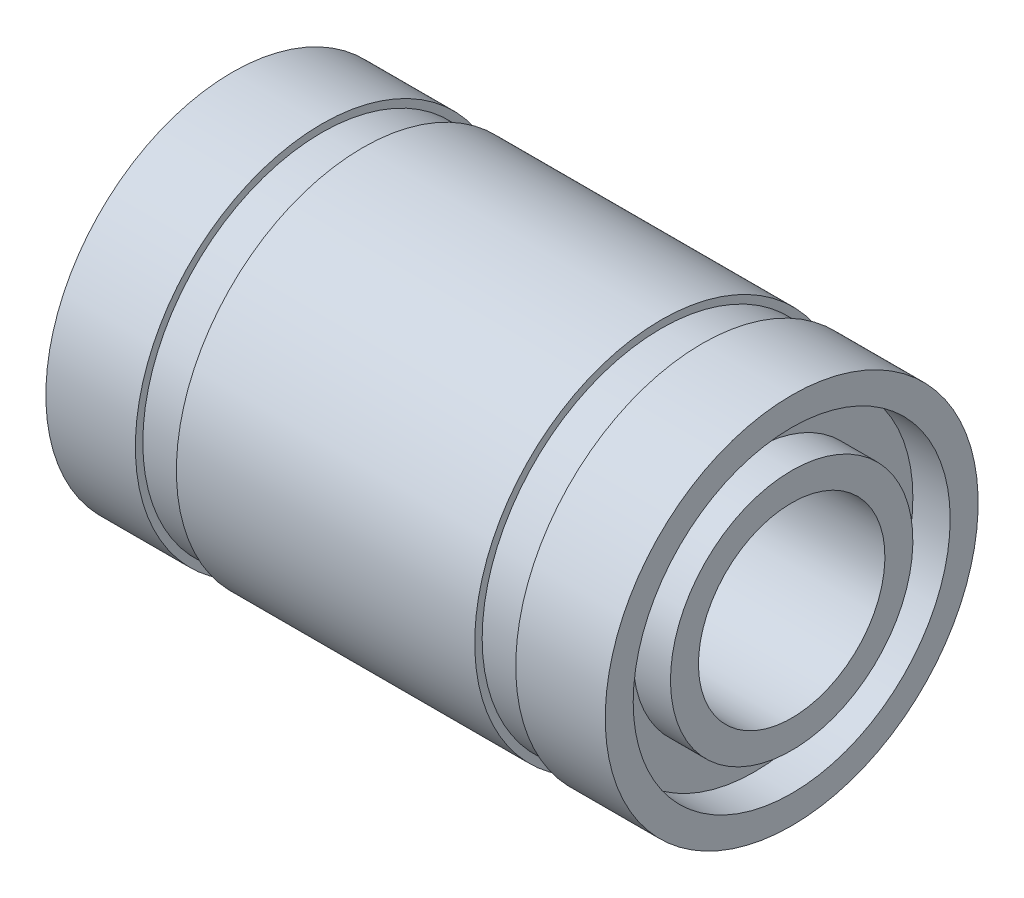
ISO-10303-21;
HEADER;
FILE_DESCRIPTION(('STEP AP214'),'2;1');
FILE_NAME('part.step','',(''),(''),'','','');
FILE_SCHEMA(('AUTOMOTIVE_DESIGN { 1 0 10303 214 1 1 1 1 }'));
ENDSEC;
DATA;
#1=APPLICATION_CONTEXT('core data for automotive mechanical design processes');
#2=APPLICATION_PROTOCOL_DEFINITION('international standard','automotive_design',2000,#1);
#3=PRODUCT_CONTEXT('',#1,'mechanical');
#4=PRODUCT('Part','Part','',(#3));
#5=PRODUCT_RELATED_PRODUCT_CATEGORY('part','',(#4));
#6=PRODUCT_DEFINITION_FORMATION('','',#4);
#7=PRODUCT_DEFINITION_CONTEXT('part definition',#1,'design');
#8=PRODUCT_DEFINITION('design','',#6,#7);
#9=PRODUCT_DEFINITION_SHAPE('','',#8);
#10=(LENGTH_UNIT() NAMED_UNIT(*) SI_UNIT(.MILLI.,.METRE.));
#11=(NAMED_UNIT(*) PLANE_ANGLE_UNIT() SI_UNIT($,.RADIAN.));
#12=(NAMED_UNIT(*) SI_UNIT($,.STERADIAN.) SOLID_ANGLE_UNIT());
#13=UNCERTAINTY_MEASURE_WITH_UNIT(LENGTH_MEASURE(1.E-05),#10,'distance_accuracy_value','');
#14=(GEOMETRIC_REPRESENTATION_CONTEXT(3) GLOBAL_UNCERTAINTY_ASSIGNED_CONTEXT((#13)) GLOBAL_UNIT_ASSIGNED_CONTEXT((#10,
#11,#12)) REPRESENTATION_CONTEXT('',''));
#15=CARTESIAN_POINT('',(0.,0.,0.));
#16=DIRECTION('',(0.,0.,1.));
#17=DIRECTION('',(1.,0.,0.));
#18=AXIS2_PLACEMENT_3D('',#15,#16,#17);
#19=CARTESIAN_POINT('',(-7.5,4.25,0.));
#20=DIRECTION('',(-1.,0.,0.));
#21=DIRECTION('',(0.,-1.,0.));
#22=AXIS2_PLACEMENT_3D('',#19,#20,#21);
#23=PLANE('',#22);
#24=CARTESIAN_POINT('',(-7.5,0.,0.));
#25=DIRECTION('',(1.,0.,0.));
#26=DIRECTION('',(0.,1.,0.));
#27=AXIS2_PLACEMENT_3D('',#24,#25,#26);
#28=CIRCLE('',#27,4.25);
#29=CARTESIAN_POINT('',(-7.5,4.25,0.));
#30=VERTEX_POINT('',#29);
#31=EDGE_CURVE('E122',#30,#30,#28,.T.);
#32=ORIENTED_EDGE('',*,*,#31,.T.);
#33=EDGE_LOOP('',(#32));
#34=FACE_BOUND('',#33,.T.);
#35=CARTESIAN_POINT('',(-7.5,0.,0.));
#36=DIRECTION('',(1.,0.,0.));
#37=DIRECTION('',(0.,1.,0.));
#38=AXIS2_PLACEMENT_3D('',#35,#36,#37);
#39=CIRCLE('',#38,5.);
#40=CARTESIAN_POINT('',(-7.5,5.,0.));
#41=VERTEX_POINT('',#40);
#42=EDGE_CURVE('E10',#41,#41,#39,.T.);
#43=ORIENTED_EDGE('',*,*,#42,.F.);
#44=EDGE_LOOP('',(#43));
#45=FACE_BOUND('',#44,.T.);
#46=ADVANCED_FACE('F38',(#34,#45),#23,.T.);
#47=CARTESIAN_POINT('',(0.,0.,0.));
#48=DIRECTION('',(1.,0.,0.));
#49=DIRECTION('',(0.,1.,0.));
#50=AXIS2_PLACEMENT_3D('',#47,#48,#49);
#51=CYLINDRICAL_SURFACE('',#50,5.);
#52=ORIENTED_EDGE('',*,*,#42,.T.);
#53=EDGE_LOOP('',(#52));
#54=FACE_BOUND('',#53,.T.);
#55=CARTESIAN_POINT('',(-5.1,0.,0.));
#56=DIRECTION('',(1.,0.,0.));
#57=DIRECTION('',(0.,1.,0.));
#58=AXIS2_PLACEMENT_3D('',#55,#56,#57);
#59=CIRCLE('',#58,5.);
#60=CARTESIAN_POINT('',(-5.1,5.,0.));
#61=VERTEX_POINT('',#60);
#62=EDGE_CURVE('E45',#61,#61,#59,.T.);
#63=ORIENTED_EDGE('',*,*,#62,.F.);
#64=EDGE_LOOP('',(#63));
#65=FACE_BOUND('',#64,.T.);
#66=ADVANCED_FACE('F140',(#54,#65),#51,.T.);
#67=CARTESIAN_POINT('',(-5.1,5.,0.));
#68=DIRECTION('',(1.,0.,0.));
#69=DIRECTION('',(0.,1.,0.));
#70=AXIS2_PLACEMENT_3D('',#67,#68,#69);
#71=PLANE('',#70);
#72=ORIENTED_EDGE('',*,*,#62,.T.);
#73=EDGE_LOOP('',(#72));
#74=FACE_BOUND('',#73,.T.);
#75=CARTESIAN_POINT('',(-5.1,0.,0.));
#76=DIRECTION('',(1.,0.,0.));
#77=DIRECTION('',(0.,1.,0.));
#78=AXIS2_PLACEMENT_3D('',#75,#76,#77);
#79=CIRCLE('',#78,4.8);
#80=CARTESIAN_POINT('',(-5.1,4.8,0.));
#81=VERTEX_POINT('',#80);
#82=EDGE_CURVE('E52',#81,#81,#79,.T.);
#83=ORIENTED_EDGE('',*,*,#82,.F.);
#84=EDGE_LOOP('',(#83));
#85=FACE_BOUND('',#84,.T.);
#86=ADVANCED_FACE('F144',(#74,#85),#71,.T.);
#87=CARTESIAN_POINT('',(0.,0.,0.));
#88=DIRECTION('',(1.,0.,0.));
#89=DIRECTION('',(0.,1.,0.));
#90=AXIS2_PLACEMENT_3D('',#87,#88,#89);
#91=CYLINDRICAL_SURFACE('',#90,4.8);
#92=ORIENTED_EDGE('',*,*,#82,.T.);
#93=EDGE_LOOP('',(#92));
#94=FACE_BOUND('',#93,.T.);
#95=CARTESIAN_POINT('',(-4.,0.,0.));
#96=DIRECTION('',(1.,0.,0.));
#97=DIRECTION('',(0.,1.,0.));
#98=AXIS2_PLACEMENT_3D('',#95,#96,#97);
#99=CIRCLE('',#98,4.8);
#100=CARTESIAN_POINT('',(-4.,4.8,0.));
#101=VERTEX_POINT('',#100);
#102=EDGE_CURVE('E59',#101,#101,#99,.T.);
#103=ORIENTED_EDGE('',*,*,#102,.F.);
#104=EDGE_LOOP('',(#103));
#105=FACE_BOUND('',#104,.T.);
#106=ADVANCED_FACE('F148',(#94,#105),#91,.T.);
#107=CARTESIAN_POINT('',(-4.,4.8,0.));
#108=DIRECTION('',(-1.,0.,0.));
#109=DIRECTION('',(0.,-1.,0.));
#110=AXIS2_PLACEMENT_3D('',#107,#108,#109);
#111=PLANE('',#110);
#112=ORIENTED_EDGE('',*,*,#102,.T.);
#113=EDGE_LOOP('',(#112));
#114=FACE_BOUND('',#113,.T.);
#115=CARTESIAN_POINT('',(-4.,0.,0.));
#116=DIRECTION('',(1.,0.,0.));
#117=DIRECTION('',(0.,1.,0.));
#118=AXIS2_PLACEMENT_3D('',#115,#116,#117);
#119=CIRCLE('',#118,5.);
#120=CARTESIAN_POINT('',(-4.,5.,0.));
#121=VERTEX_POINT('',#120);
#122=EDGE_CURVE('E65',#121,#121,#119,.T.);
#123=ORIENTED_EDGE('',*,*,#122,.F.);
#124=EDGE_LOOP('',(#123));
#125=FACE_BOUND('',#124,.T.);
#126=ADVANCED_FACE('F154',(#114,#125),#111,.T.);
#127=CARTESIAN_POINT('',(0.,0.,0.));
#128=DIRECTION('',(1.,0.,0.));
#129=DIRECTION('',(0.,1.,0.));
#130=AXIS2_PLACEMENT_3D('',#127,#128,#129);
#131=CYLINDRICAL_SURFACE('',#130,5.);
#132=ORIENTED_EDGE('',*,*,#122,.T.);
#133=EDGE_LOOP('',(#132));
#134=FACE_BOUND('',#133,.T.);
#135=CARTESIAN_POINT('',(4.,0.,0.));
#136=DIRECTION('',(1.,0.,0.));
#137=DIRECTION('',(0.,1.,0.));
#138=AXIS2_PLACEMENT_3D('',#135,#136,#137);
#139=CIRCLE('',#138,5.);
#140=CARTESIAN_POINT('',(4.,5.,0.));
#141=VERTEX_POINT('',#140);
#142=EDGE_CURVE('E69',#141,#141,#139,.T.);
#143=ORIENTED_EDGE('',*,*,#142,.F.);
#144=EDGE_LOOP('',(#143));
#145=FACE_BOUND('',#144,.T.);
#146=ADVANCED_FACE('F158',(#134,#145),#131,.T.);
#147=CARTESIAN_POINT('',(4.,5.,0.));
#148=DIRECTION('',(1.,0.,0.));
#149=DIRECTION('',(0.,1.,0.));
#150=AXIS2_PLACEMENT_3D('',#147,#148,#149);
#151=PLANE('',#150);
#152=ORIENTED_EDGE('',*,*,#142,.T.);
#153=EDGE_LOOP('',(#152));
#154=FACE_BOUND('',#153,.T.);
#155=CARTESIAN_POINT('',(4.,0.,0.));
#156=DIRECTION('',(1.,0.,0.));
#157=DIRECTION('',(0.,1.,0.));
#158=AXIS2_PLACEMENT_3D('',#155,#156,#157);
#159=CIRCLE('',#158,4.8);
#160=CARTESIAN_POINT('',(4.,4.8,0.));
#161=VERTEX_POINT('',#160);
#162=EDGE_CURVE('E72',#161,#161,#159,.T.);
#163=ORIENTED_EDGE('',*,*,#162,.F.);
#164=EDGE_LOOP('',(#163));
#165=FACE_BOUND('',#164,.T.);
#166=ADVANCED_FACE('F162',(#154,#165),#151,.T.);
#167=CARTESIAN_POINT('',(0.,0.,0.));
#168=DIRECTION('',(1.,0.,0.));
#169=DIRECTION('',(0.,1.,0.));
#170=AXIS2_PLACEMENT_3D('',#167,#168,#169);
#171=CYLINDRICAL_SURFACE('',#170,4.8);
#172=ORIENTED_EDGE('',*,*,#162,.T.);
#173=EDGE_LOOP('',(#172));
#174=FACE_BOUND('',#173,.T.);
#175=CARTESIAN_POINT('',(5.1,0.,0.));
#176=DIRECTION('',(1.,0.,0.));
#177=DIRECTION('',(0.,1.,0.));
#178=AXIS2_PLACEMENT_3D('',#175,#176,#177);
#179=CIRCLE('',#178,4.8);
#180=CARTESIAN_POINT('',(5.1,4.8,0.));
#181=VERTEX_POINT('',#180);
#182=EDGE_CURVE('E75',#181,#181,#179,.T.);
#183=ORIENTED_EDGE('',*,*,#182,.F.);
#184=EDGE_LOOP('',(#183));
#185=FACE_BOUND('',#184,.T.);
#186=ADVANCED_FACE('F166',(#174,#185),#171,.T.);
#187=CARTESIAN_POINT('',(5.1,4.8,0.));
#188=DIRECTION('',(-1.,0.,0.));
#189=DIRECTION('',(0.,-1.,0.));
#190=AXIS2_PLACEMENT_3D('',#187,#188,#189);
#191=PLANE('',#190);
#192=ORIENTED_EDGE('',*,*,#182,.T.);
#193=EDGE_LOOP('',(#192));
#194=FACE_BOUND('',#193,.T.);
#195=CARTESIAN_POINT('',(5.1,0.,0.));
#196=DIRECTION('',(1.,0.,0.));
#197=DIRECTION('',(0.,1.,0.));
#198=AXIS2_PLACEMENT_3D('',#195,#196,#197);
#199=CIRCLE('',#198,5.);
#200=CARTESIAN_POINT('',(5.1,5.,0.));
#201=VERTEX_POINT('',#200);
#202=EDGE_CURVE('E79',#201,#201,#199,.T.);
#203=ORIENTED_EDGE('',*,*,#202,.F.);
#204=EDGE_LOOP('',(#203));
#205=FACE_BOUND('',#204,.T.);
#206=ADVANCED_FACE('F170',(#194,#205),#191,.T.);
#207=CARTESIAN_POINT('',(0.,0.,0.));
#208=DIRECTION('',(1.,0.,0.));
#209=DIRECTION('',(0.,1.,0.));
#210=AXIS2_PLACEMENT_3D('',#207,#208,#209);
#211=CYLINDRICAL_SURFACE('',#210,5.00000000000001);
#212=ORIENTED_EDGE('',*,*,#202,.T.);
#213=EDGE_LOOP('',(#212));
#214=FACE_BOUND('',#213,.T.);
#215=CARTESIAN_POINT('',(7.5,0.,0.));
#216=DIRECTION('',(1.,0.,0.));
#217=DIRECTION('',(0.,1.,0.));
#218=AXIS2_PLACEMENT_3D('',#215,#216,#217);
#219=CIRCLE('',#218,5.00000000000002);
#220=CARTESIAN_POINT('',(7.5,5.00000000000002,0.));
#221=VERTEX_POINT('',#220);
#222=EDGE_CURVE('E83',#221,#221,#219,.T.);
#223=ORIENTED_EDGE('',*,*,#222,.F.);
#224=EDGE_LOOP('',(#223));
#225=FACE_BOUND('',#224,.T.);
#226=ADVANCED_FACE('F174',(#214,#225),#211,.T.);
#227=CARTESIAN_POINT('',(7.5,5.00000000000002,0.));
#228=DIRECTION('',(1.,0.,0.));
#229=DIRECTION('',(0.,1.,0.));
#230=AXIS2_PLACEMENT_3D('',#227,#228,#229);
#231=PLANE('',#230);
#232=ORIENTED_EDGE('',*,*,#222,.T.);
#233=EDGE_LOOP('',(#232));
#234=FACE_BOUND('',#233,.T.);
#235=CARTESIAN_POINT('',(7.5,0.,0.));
#236=DIRECTION('',(1.,0.,0.));
#237=DIRECTION('',(0.,1.,0.));
#238=AXIS2_PLACEMENT_3D('',#235,#236,#237);
#239=CIRCLE('',#238,4.25000000000001);
#240=CARTESIAN_POINT('',(7.5,4.25000000000001,0.));
#241=VERTEX_POINT('',#240);
#242=EDGE_CURVE('E87',#241,#241,#239,.T.);
#243=ORIENTED_EDGE('',*,*,#242,.F.);
#244=EDGE_LOOP('',(#243));
#245=FACE_BOUND('',#244,.T.);
#246=ADVANCED_FACE('F178',(#234,#245),#231,.T.);
#247=CARTESIAN_POINT('',(0.,0.,0.));
#248=DIRECTION('',(1.,0.,0.));
#249=DIRECTION('',(0.,1.,0.));
#250=AXIS2_PLACEMENT_3D('',#247,#248,#249);
#251=CYLINDRICAL_SURFACE('',#250,4.25000000000001);
#252=ORIENTED_EDGE('',*,*,#242,.T.);
#253=EDGE_LOOP('',(#252));
#254=FACE_BOUND('',#253,.T.);
#255=CARTESIAN_POINT('',(6.5,0.,0.));
#256=DIRECTION('',(1.,0.,0.));
#257=DIRECTION('',(0.,1.,0.));
#258=AXIS2_PLACEMENT_3D('',#255,#256,#257);
#259=CIRCLE('',#258,4.25000000000001);
#260=CARTESIAN_POINT('',(6.5,4.25000000000001,0.));
#261=VERTEX_POINT('',#260);
#262=EDGE_CURVE('E91',#261,#261,#259,.T.);
#263=ORIENTED_EDGE('',*,*,#262,.F.);
#264=EDGE_LOOP('',(#263));
#265=FACE_BOUND('',#264,.T.);
#266=ADVANCED_FACE('F182',(#254,#265),#251,.F.);
#267=CARTESIAN_POINT('',(6.5,4.25000000000001,0.));
#268=DIRECTION('',(1.,0.,0.));
#269=DIRECTION('',(0.,1.,0.));
#270=AXIS2_PLACEMENT_3D('',#267,#268,#269);
#271=PLANE('',#270);
#272=ORIENTED_EDGE('',*,*,#262,.T.);
#273=EDGE_LOOP('',(#272));
#274=FACE_BOUND('',#273,.T.);
#275=CARTESIAN_POINT('',(6.5,0.,0.));
#276=DIRECTION('',(1.,0.,0.));
#277=DIRECTION('',(0.,1.,0.));
#278=AXIS2_PLACEMENT_3D('',#275,#276,#277);
#279=CIRCLE('',#278,3.25000000000001);
#280=CARTESIAN_POINT('',(6.5,3.25000000000001,0.));
#281=VERTEX_POINT('',#280);
#282=EDGE_CURVE('E95',#281,#281,#279,.T.);
#283=ORIENTED_EDGE('',*,*,#282,.F.);
#284=EDGE_LOOP('',(#283));
#285=FACE_BOUND('',#284,.T.);
#286=ADVANCED_FACE('F186',(#274,#285),#271,.T.);
#287=CARTESIAN_POINT('',(0.,0.,0.));
#288=DIRECTION('',(1.,0.,0.));
#289=DIRECTION('',(0.,1.,0.));
#290=AXIS2_PLACEMENT_3D('',#287,#288,#289);
#291=CYLINDRICAL_SURFACE('',#290,3.25000000000001);
#292=ORIENTED_EDGE('',*,*,#282,.T.);
#293=EDGE_LOOP('',(#292));
#294=FACE_BOUND('',#293,.T.);
#295=CARTESIAN_POINT('',(7.5,0.,0.));
#296=DIRECTION('',(1.,0.,0.));
#297=DIRECTION('',(0.,1.,0.));
#298=AXIS2_PLACEMENT_3D('',#295,#296,#297);
#299=CIRCLE('',#298,3.25000000000001);
#300=CARTESIAN_POINT('',(7.5,3.25000000000001,0.));
#301=VERTEX_POINT('',#300);
#302=EDGE_CURVE('E99',#301,#301,#299,.T.);
#303=ORIENTED_EDGE('',*,*,#302,.F.);
#304=EDGE_LOOP('',(#303));
#305=FACE_BOUND('',#304,.T.);
#306=ADVANCED_FACE('F190',(#294,#305),#291,.T.);
#307=CARTESIAN_POINT('',(7.5,3.25000000000001,0.));
#308=DIRECTION('',(1.,0.,0.));
#309=DIRECTION('',(0.,1.,0.));
#310=AXIS2_PLACEMENT_3D('',#307,#308,#309);
#311=PLANE('',#310);
#312=ORIENTED_EDGE('',*,*,#302,.T.);
#313=EDGE_LOOP('',(#312));
#314=FACE_BOUND('',#313,.T.);
#315=CARTESIAN_POINT('',(7.5,0.,0.));
#316=DIRECTION('',(1.,0.,0.));
#317=DIRECTION('',(0.,1.,0.));
#318=AXIS2_PLACEMENT_3D('',#315,#316,#317);
#319=CIRCLE('',#318,2.5);
#320=CARTESIAN_POINT('',(7.5,2.5,0.));
#321=VERTEX_POINT('',#320);
#322=EDGE_CURVE('E103',#321,#321,#319,.T.);
#323=ORIENTED_EDGE('',*,*,#322,.F.);
#324=EDGE_LOOP('',(#323));
#325=FACE_BOUND('',#324,.T.);
#326=ADVANCED_FACE('F194',(#314,#325),#311,.T.);
#327=CARTESIAN_POINT('',(0.,0.,0.));
#328=DIRECTION('',(1.,0.,0.));
#329=DIRECTION('',(0.,1.,0.));
#330=AXIS2_PLACEMENT_3D('',#327,#328,#329);
#331=CYLINDRICAL_SURFACE('',#330,2.5);
#332=ORIENTED_EDGE('',*,*,#322,.T.);
#333=EDGE_LOOP('',(#332));
#334=FACE_BOUND('',#333,.T.);
#335=CARTESIAN_POINT('',(-7.5,0.,0.));
#336=DIRECTION('',(1.,0.,0.));
#337=DIRECTION('',(0.,1.,0.));
#338=AXIS2_PLACEMENT_3D('',#335,#336,#337);
#339=CIRCLE('',#338,2.5);
#340=CARTESIAN_POINT('',(-7.5,2.5,0.));
#341=VERTEX_POINT('',#340);
#342=EDGE_CURVE('E107',#341,#341,#339,.T.);
#343=ORIENTED_EDGE('',*,*,#342,.F.);
#344=EDGE_LOOP('',(#343));
#345=FACE_BOUND('',#344,.T.);
#346=ADVANCED_FACE('F198',(#334,#345),#331,.F.);
#347=CARTESIAN_POINT('',(-7.5,2.5,0.));
#348=DIRECTION('',(-1.,0.,0.));
#349=DIRECTION('',(0.,-1.,0.));
#350=AXIS2_PLACEMENT_3D('',#347,#348,#349);
#351=PLANE('',#350);
#352=ORIENTED_EDGE('',*,*,#342,.T.);
#353=EDGE_LOOP('',(#352));
#354=FACE_BOUND('',#353,.T.);
#355=CARTESIAN_POINT('',(-7.5,0.,0.));
#356=DIRECTION('',(1.,0.,0.));
#357=DIRECTION('',(0.,1.,0.));
#358=AXIS2_PLACEMENT_3D('',#355,#356,#357);
#359=CIRCLE('',#358,3.25);
#360=CARTESIAN_POINT('',(-7.5,3.25,0.));
#361=VERTEX_POINT('',#360);
#362=EDGE_CURVE('E111',#361,#361,#359,.T.);
#363=ORIENTED_EDGE('',*,*,#362,.F.);
#364=EDGE_LOOP('',(#363));
#365=FACE_BOUND('',#364,.T.);
#366=ADVANCED_FACE('F202',(#354,#365),#351,.T.);
#367=CARTESIAN_POINT('',(0.,0.,0.));
#368=DIRECTION('',(1.,0.,0.));
#369=DIRECTION('',(0.,1.,0.));
#370=AXIS2_PLACEMENT_3D('',#367,#368,#369);
#371=CYLINDRICAL_SURFACE('',#370,3.25);
#372=ORIENTED_EDGE('',*,*,#362,.T.);
#373=EDGE_LOOP('',(#372));
#374=FACE_BOUND('',#373,.T.);
#375=CARTESIAN_POINT('',(-6.5,0.,0.));
#376=DIRECTION('',(1.,0.,0.));
#377=DIRECTION('',(0.,1.,0.));
#378=AXIS2_PLACEMENT_3D('',#375,#376,#377);
#379=CIRCLE('',#378,3.25);
#380=CARTESIAN_POINT('',(-6.5,3.25,0.));
#381=VERTEX_POINT('',#380);
#382=EDGE_CURVE('E115',#381,#381,#379,.T.);
#383=ORIENTED_EDGE('',*,*,#382,.F.);
#384=EDGE_LOOP('',(#383));
#385=FACE_BOUND('',#384,.T.);
#386=ADVANCED_FACE('F136',(#374,#385),#371,.T.);
#387=CARTESIAN_POINT('',(-6.5,4.25,0.));
#388=DIRECTION('',(-1.,0.,0.));
#389=DIRECTION('',(0.,-1.,0.));
#390=AXIS2_PLACEMENT_3D('',#387,#388,#389);
#391=PLANE('',#390);
#392=ORIENTED_EDGE('',*,*,#382,.T.);
#393=EDGE_LOOP('',(#392));
#394=FACE_BOUND('',#393,.T.);
#395=CARTESIAN_POINT('',(-6.5,0.,0.));
#396=DIRECTION('',(1.,0.,0.));
#397=DIRECTION('',(0.,1.,0.));
#398=AXIS2_PLACEMENT_3D('',#395,#396,#397);
#399=CIRCLE('',#398,4.25);
#400=CARTESIAN_POINT('',(-6.5,4.25,0.));
#401=VERTEX_POINT('',#400);
#402=EDGE_CURVE('E119',#401,#401,#399,.T.);
#403=ORIENTED_EDGE('',*,*,#402,.F.);
#404=EDGE_LOOP('',(#403));
#405=FACE_BOUND('',#404,.T.);
#406=ADVANCED_FACE('F130',(#394,#405),#391,.T.);
#407=CARTESIAN_POINT('',(0.,0.,0.));
#408=DIRECTION('',(1.,0.,0.));
#409=DIRECTION('',(0.,1.,0.));
#410=AXIS2_PLACEMENT_3D('',#407,#408,#409);
#411=CYLINDRICAL_SURFACE('',#410,4.25);
#412=ORIENTED_EDGE('',*,*,#402,.T.);
#413=EDGE_LOOP('',(#412));
#414=FACE_BOUND('',#413,.T.);
#415=ORIENTED_EDGE('',*,*,#31,.F.);
#416=EDGE_LOOP('',(#415));
#417=FACE_BOUND('',#416,.T.);
#418=ADVANCED_FACE('F128',(#414,#417),#411,.F.);
#419=CLOSED_SHELL('',(#46,#66,#86,#106,#126,#146,#166,#186,#206,#226,#246,#266,#286,#306,#326,
#346,#366,#386,#406,#418));
#420=MANIFOLD_SOLID_BREP('B2',#419);
#421=ADVANCED_BREP_SHAPE_REPRESENTATION('',(#18,#420),#14);
#422=SHAPE_DEFINITION_REPRESENTATION(#9,#421);
ENDSEC;
END-ISO-10303-21;
